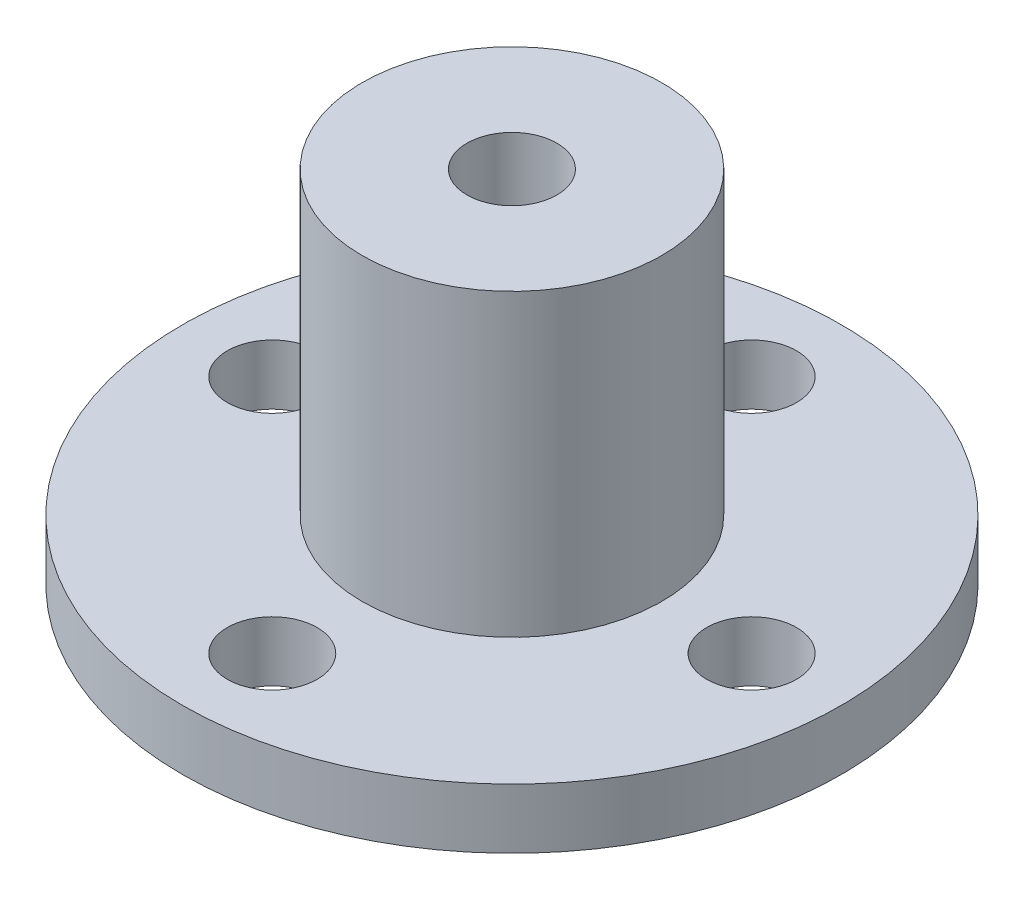
ISO-10303-21;
HEADER;
FILE_DESCRIPTION(('STEP AP214'),'2;1');
FILE_NAME('part.step','',(''),(''),'','','');
FILE_SCHEMA(('AUTOMOTIVE_DESIGN { 1 0 10303 214 1 1 1 1 }'));
ENDSEC;
DATA;
#1=APPLICATION_CONTEXT('core data for automotive mechanical design processes');
#2=APPLICATION_PROTOCOL_DEFINITION('international standard','automotive_design',2000,#1);
#3=PRODUCT_CONTEXT('',#1,'mechanical');
#4=PRODUCT('Part','Part','',(#3));
#5=PRODUCT_RELATED_PRODUCT_CATEGORY('part','',(#4));
#6=PRODUCT_DEFINITION_FORMATION('','',#4);
#7=PRODUCT_DEFINITION_CONTEXT('part definition',#1,'design');
#8=PRODUCT_DEFINITION('design','',#6,#7);
#9=PRODUCT_DEFINITION_SHAPE('','',#8);
#10=(LENGTH_UNIT() NAMED_UNIT(*) SI_UNIT(.MILLI.,.METRE.));
#11=(NAMED_UNIT(*) PLANE_ANGLE_UNIT() SI_UNIT($,.RADIAN.));
#12=(NAMED_UNIT(*) SI_UNIT($,.STERADIAN.) SOLID_ANGLE_UNIT());
#13=UNCERTAINTY_MEASURE_WITH_UNIT(LENGTH_MEASURE(1.E-05),#10,'distance_accuracy_value','');
#14=(GEOMETRIC_REPRESENTATION_CONTEXT(3) GLOBAL_UNCERTAINTY_ASSIGNED_CONTEXT((#13)) GLOBAL_UNIT_ASSIGNED_CONTEXT((#10,
#11,#12)) REPRESENTATION_CONTEXT('',''));
#15=CARTESIAN_POINT('',(0.,0.,0.));
#16=DIRECTION('',(0.,0.,1.));
#17=DIRECTION('',(1.,0.,0.));
#18=AXIS2_PLACEMENT_3D('',#15,#16,#17);
#19=CARTESIAN_POINT('',(0.,2.,8.));
#20=DIRECTION('',(0.,-1.,0.));
#21=DIRECTION('',(0.,0.,-1.));
#22=AXIS2_PLACEMENT_3D('',#19,#20,#21);
#23=CYLINDRICAL_SURFACE('',#22,1.5);
#24=CARTESIAN_POINT('',(0.,2.,8.));
#25=DIRECTION('',(0.,1.,0.));
#26=DIRECTION('',(0.,0.,1.));
#27=AXIS2_PLACEMENT_3D('',#24,#25,#26);
#28=CIRCLE('',#27,1.5);
#29=CARTESIAN_POINT('',(0.,2.,9.5));
#30=VERTEX_POINT('',#29);
#31=EDGE_CURVE('E39',#30,#30,#28,.T.);
#32=ORIENTED_EDGE('',*,*,#31,.T.);
#33=EDGE_LOOP('',(#32));
#34=FACE_BOUND('',#33,.T.);
#35=CARTESIAN_POINT('',(0.,0.,8.));
#36=DIRECTION('',(0.,1.,0.));
#37=DIRECTION('',(0.,0.,1.));
#38=AXIS2_PLACEMENT_3D('',#35,#36,#37);
#39=CIRCLE('',#38,1.5);
#40=CARTESIAN_POINT('',(0.,0.,9.5));
#41=VERTEX_POINT('',#40);
#42=EDGE_CURVE('E35',#41,#41,#39,.T.);
#43=ORIENTED_EDGE('',*,*,#42,.F.);
#44=EDGE_LOOP('',(#43));
#45=FACE_BOUND('',#44,.T.);
#46=ADVANCED_FACE('F31',(#34,#45),#23,.F.);
#47=CARTESIAN_POINT('',(-8.,2.,0.));
#48=DIRECTION('',(0.,-1.,0.));
#49=DIRECTION('',(0.,0.,-1.));
#50=AXIS2_PLACEMENT_3D('',#47,#48,#49);
#51=CYLINDRICAL_SURFACE('',#50,1.5);
#52=CARTESIAN_POINT('',(-8.,2.,0.));
#53=DIRECTION('',(0.,1.,0.));
#54=DIRECTION('',(0.,0.,1.));
#55=AXIS2_PLACEMENT_3D('',#52,#53,#54);
#56=CIRCLE('',#55,1.5);
#57=CARTESIAN_POINT('',(-8.,2.,1.49999999999994));
#58=VERTEX_POINT('',#57);
#59=EDGE_CURVE('E44',#58,#58,#56,.T.);
#60=ORIENTED_EDGE('',*,*,#59,.T.);
#61=EDGE_LOOP('',(#60));
#62=FACE_BOUND('',#61,.T.);
#63=CARTESIAN_POINT('',(-8.,0.,0.));
#64=DIRECTION('',(0.,1.,0.));
#65=DIRECTION('',(0.,0.,1.));
#66=AXIS2_PLACEMENT_3D('',#63,#64,#65);
#67=CIRCLE('',#66,1.5);
#68=CARTESIAN_POINT('',(-8.,0.,1.49999999999994));
#69=VERTEX_POINT('',#68);
#70=EDGE_CURVE('E57',#69,#69,#67,.T.);
#71=ORIENTED_EDGE('',*,*,#70,.F.);
#72=EDGE_LOOP('',(#71));
#73=FACE_BOUND('',#72,.T.);
#74=ADVANCED_FACE('F80',(#62,#73),#51,.F.);
#75=CARTESIAN_POINT('',(0.,2.,-8.));
#76=DIRECTION('',(0.,-1.,0.));
#77=DIRECTION('',(0.,0.,-1.));
#78=AXIS2_PLACEMENT_3D('',#75,#76,#77);
#79=CYLINDRICAL_SURFACE('',#78,1.5);
#80=CARTESIAN_POINT('',(0.,2.,-8.));
#81=DIRECTION('',(0.,1.,0.));
#82=DIRECTION('',(0.,0.,1.));
#83=AXIS2_PLACEMENT_3D('',#80,#81,#82);
#84=CIRCLE('',#83,1.5);
#85=CARTESIAN_POINT('',(0.,2.,-6.5));
#86=VERTEX_POINT('',#85);
#87=EDGE_CURVE('E71',#86,#86,#84,.T.);
#88=ORIENTED_EDGE('',*,*,#87,.T.);
#89=EDGE_LOOP('',(#88));
#90=FACE_BOUND('',#89,.T.);
#91=CARTESIAN_POINT('',(0.,0.,-8.));
#92=DIRECTION('',(0.,1.,0.));
#93=DIRECTION('',(0.,0.,1.));
#94=AXIS2_PLACEMENT_3D('',#91,#92,#93);
#95=CIRCLE('',#94,1.5);
#96=CARTESIAN_POINT('',(0.,0.,-6.5));
#97=VERTEX_POINT('',#96);
#98=EDGE_CURVE('E55',#97,#97,#95,.T.);
#99=ORIENTED_EDGE('',*,*,#98,.F.);
#100=EDGE_LOOP('',(#99));
#101=FACE_BOUND('',#100,.T.);
#102=ADVANCED_FACE('F97',(#90,#101),#79,.F.);
#103=CARTESIAN_POINT('',(8.,2.,0.));
#104=DIRECTION('',(0.,-1.,0.));
#105=DIRECTION('',(0.,0.,-1.));
#106=AXIS2_PLACEMENT_3D('',#103,#104,#105);
#107=CYLINDRICAL_SURFACE('',#106,1.5);
#108=CARTESIAN_POINT('',(8.,2.,0.));
#109=DIRECTION('',(0.,1.,0.));
#110=DIRECTION('',(0.,0.,1.));
#111=AXIS2_PLACEMENT_3D('',#108,#109,#110);
#112=CIRCLE('',#111,1.5);
#113=CARTESIAN_POINT('',(8.,2.,1.5));
#114=VERTEX_POINT('',#113);
#115=EDGE_CURVE('E66',#114,#114,#112,.T.);
#116=ORIENTED_EDGE('',*,*,#115,.T.);
#117=EDGE_LOOP('',(#116));
#118=FACE_BOUND('',#117,.T.);
#119=CARTESIAN_POINT('',(8.,0.,0.));
#120=DIRECTION('',(0.,1.,0.));
#121=DIRECTION('',(0.,0.,1.));
#122=AXIS2_PLACEMENT_3D('',#119,#120,#121);
#123=CIRCLE('',#122,1.5);
#124=CARTESIAN_POINT('',(8.,0.,1.5));
#125=VERTEX_POINT('',#124);
#126=EDGE_CURVE('E51',#125,#125,#123,.T.);
#127=ORIENTED_EDGE('',*,*,#126,.F.);
#128=EDGE_LOOP('',(#127));
#129=FACE_BOUND('',#128,.T.);
#130=ADVANCED_FACE('F102',(#118,#129),#107,.F.);
#131=CARTESIAN_POINT('',(0.,2.,0.));
#132=DIRECTION('',(0.,-1.,0.));
#133=DIRECTION('',(0.,0.,-1.));
#134=AXIS2_PLACEMENT_3D('',#131,#132,#133);
#135=CYLINDRICAL_SURFACE('',#134,11.);
#136=CARTESIAN_POINT('',(0.,2.,0.));
#137=DIRECTION('',(0.,1.,0.));
#138=DIRECTION('',(0.,0.,1.));
#139=AXIS2_PLACEMENT_3D('',#136,#137,#138);
#140=CIRCLE('',#139,11.);
#141=CARTESIAN_POINT('',(0.,2.,11.));
#142=VERTEX_POINT('',#141);
#143=EDGE_CURVE('E62',#142,#142,#140,.T.);
#144=ORIENTED_EDGE('',*,*,#143,.F.);
#145=EDGE_LOOP('',(#144));
#146=FACE_BOUND('',#145,.T.);
#147=CARTESIAN_POINT('',(0.,0.,0.));
#148=DIRECTION('',(0.,1.,0.));
#149=DIRECTION('',(0.,0.,1.));
#150=AXIS2_PLACEMENT_3D('',#147,#148,#149);
#151=CIRCLE('',#150,11.);
#152=CARTESIAN_POINT('',(0.,0.,11.));
#153=VERTEX_POINT('',#152);
#154=EDGE_CURVE('E48',#153,#153,#151,.T.);
#155=ORIENTED_EDGE('',*,*,#154,.T.);
#156=EDGE_LOOP('',(#155));
#157=FACE_BOUND('',#156,.T.);
#158=ADVANCED_FACE('F33',(#146,#157),#135,.T.);
#159=CARTESIAN_POINT('',(0.,2.,0.));
#160=DIRECTION('',(0.,1.,0.));
#161=DIRECTION('',(0.,0.,1.));
#162=AXIS2_PLACEMENT_3D('',#159,#160,#161);
#163=PLANE('',#162);
#164=ORIENTED_EDGE('',*,*,#143,.T.);
#165=EDGE_LOOP('',(#164));
#166=FACE_BOUND('',#165,.T.);
#167=ORIENTED_EDGE('',*,*,#115,.F.);
#168=EDGE_LOOP('',(#167));
#169=FACE_BOUND('',#168,.T.);
#170=ORIENTED_EDGE('',*,*,#87,.F.);
#171=EDGE_LOOP('',(#170));
#172=FACE_BOUND('',#171,.T.);
#173=ORIENTED_EDGE('',*,*,#59,.F.);
#174=EDGE_LOOP('',(#173));
#175=FACE_BOUND('',#174,.T.);
#176=ORIENTED_EDGE('',*,*,#31,.F.);
#177=EDGE_LOOP('',(#176));
#178=FACE_BOUND('',#177,.T.);
#179=CARTESIAN_POINT('',(0.,2.,0.));
#180=DIRECTION('',(0.,1.,0.));
#181=DIRECTION('',(0.,0.,1.));
#182=AXIS2_PLACEMENT_3D('',#179,#180,#181);
#183=CIRCLE('',#182,5.);
#184=CARTESIAN_POINT('',(0.,2.,5.));
#185=VERTEX_POINT('',#184);
#186=EDGE_CURVE('E10',#185,#185,#183,.T.);
#187=ORIENTED_EDGE('',*,*,#186,.F.);
#188=EDGE_LOOP('',(#187));
#189=FACE_BOUND('',#188,.T.);
#190=ADVANCED_FACE('F83',(#166,#169,#172,#175,#178,#189),#163,.T.);
#191=CARTESIAN_POINT('',(0.,0.,0.));
#192=DIRECTION('',(0.,1.,0.));
#193=DIRECTION('',(0.,0.,1.));
#194=AXIS2_PLACEMENT_3D('',#191,#192,#193);
#195=PLANE('',#194);
#196=ORIENTED_EDGE('',*,*,#154,.F.);
#197=EDGE_LOOP('',(#196));
#198=FACE_BOUND('',#197,.T.);
#199=ORIENTED_EDGE('',*,*,#126,.T.);
#200=EDGE_LOOP('',(#199));
#201=FACE_BOUND('',#200,.T.);
#202=ORIENTED_EDGE('',*,*,#98,.T.);
#203=EDGE_LOOP('',(#202));
#204=FACE_BOUND('',#203,.T.);
#205=ORIENTED_EDGE('',*,*,#70,.T.);
#206=EDGE_LOOP('',(#205));
#207=FACE_BOUND('',#206,.T.);
#208=ORIENTED_EDGE('',*,*,#42,.T.);
#209=EDGE_LOOP('',(#208));
#210=FACE_BOUND('',#209,.T.);
#211=ADVANCED_FACE('F86',(#198,#201,#204,#207,#210),#195,.F.);
#212=CARTESIAN_POINT('',(0.,12.,0.));
#213=DIRECTION('',(0.,-1.,0.));
#214=DIRECTION('',(0.,0.,-1.));
#215=AXIS2_PLACEMENT_3D('',#212,#213,#214);
#216=CYLINDRICAL_SURFACE('',#215,5.);
#217=ORIENTED_EDGE('',*,*,#186,.T.);
#218=EDGE_LOOP('',(#217));
#219=FACE_BOUND('',#218,.T.);
#220=CARTESIAN_POINT('',(0.,12.,0.));
#221=DIRECTION('',(0.,1.,0.));
#222=DIRECTION('',(0.,0.,1.));
#223=AXIS2_PLACEMENT_3D('',#220,#221,#222);
#224=CIRCLE('',#223,5.);
#225=CARTESIAN_POINT('',(0.,12.,5.));
#226=VERTEX_POINT('',#225);
#227=EDGE_CURVE('E52',#226,#226,#224,.T.);
#228=ORIENTED_EDGE('',*,*,#227,.F.);
#229=EDGE_LOOP('',(#228));
#230=FACE_BOUND('',#229,.T.);
#231=ADVANCED_FACE('F116',(#219,#230),#216,.T.);
#232=CARTESIAN_POINT('',(0.,12.,0.));
#233=DIRECTION('',(0.,1.,0.));
#234=DIRECTION('',(0.,0.,1.));
#235=AXIS2_PLACEMENT_3D('',#232,#233,#234);
#236=PLANE('',#235);
#237=CARTESIAN_POINT('',(0.,12.,0.));
#238=DIRECTION('',(0.,1.,0.));
#239=DIRECTION('',(0.,0.,1.));
#240=AXIS2_PLACEMENT_3D('',#237,#238,#239);
#241=CIRCLE('',#240,1.5);
#242=CARTESIAN_POINT('',(0.,12.,1.5));
#243=VERTEX_POINT('',#242);
#244=EDGE_CURVE('E146',#243,#243,#241,.T.);
#245=ORIENTED_EDGE('',*,*,#244,.F.);
#246=EDGE_LOOP('',(#245));
#247=FACE_BOUND('',#246,.T.);
#248=ORIENTED_EDGE('',*,*,#227,.T.);
#249=EDGE_LOOP('',(#248));
#250=FACE_BOUND('',#249,.T.);
#251=ADVANCED_FACE('F123',(#247,#250),#236,.T.);
#252=CARTESIAN_POINT('',(0.,2.,0.));
#253=DIRECTION('',(0.,1.,0.));
#254=DIRECTION('',(0.,0.,1.));
#255=AXIS2_PLACEMENT_3D('',#252,#253,#254);
#256=CYLINDRICAL_SURFACE('',#255,1.5);
#257=CARTESIAN_POINT('',(0.,2.,0.));
#258=DIRECTION('',(0.,1.,0.));
#259=DIRECTION('',(0.,0.,1.));
#260=AXIS2_PLACEMENT_3D('',#257,#258,#259);
#261=CIRCLE('',#260,1.5);
#262=CARTESIAN_POINT('',(0.,2.,1.5));
#263=VERTEX_POINT('',#262);
#264=EDGE_CURVE('E145',#263,#263,#261,.T.);
#265=ORIENTED_EDGE('',*,*,#264,.F.);
#266=EDGE_LOOP('',(#265));
#267=FACE_BOUND('',#266,.T.);
#268=ORIENTED_EDGE('',*,*,#244,.T.);
#269=EDGE_LOOP('',(#268));
#270=FACE_BOUND('',#269,.T.);
#271=ADVANCED_FACE('F130',(#267,#270),#256,.F.);
#272=CARTESIAN_POINT('',(0.,2.,0.));
#273=DIRECTION('',(0.,1.,0.));
#274=DIRECTION('',(0.,0.,1.));
#275=AXIS2_PLACEMENT_3D('',#272,#273,#274);
#276=PLANE('',#275);
#277=ORIENTED_EDGE('',*,*,#264,.T.);
#278=EDGE_LOOP('',(#277));
#279=FACE_BOUND('',#278,.T.);
#280=ADVANCED_FACE('F137',(#279),#276,.T.);
#281=CLOSED_SHELL('',(#46,#74,#102,#130,#158,#190,#211,#231,#251,#271,#280));
#282=MANIFOLD_SOLID_BREP('B2',#281);
#283=ADVANCED_BREP_SHAPE_REPRESENTATION('',(#18,#282),#14);
#284=SHAPE_DEFINITION_REPRESENTATION(#9,#283);
ENDSEC;
END-ISO-10303-21;
